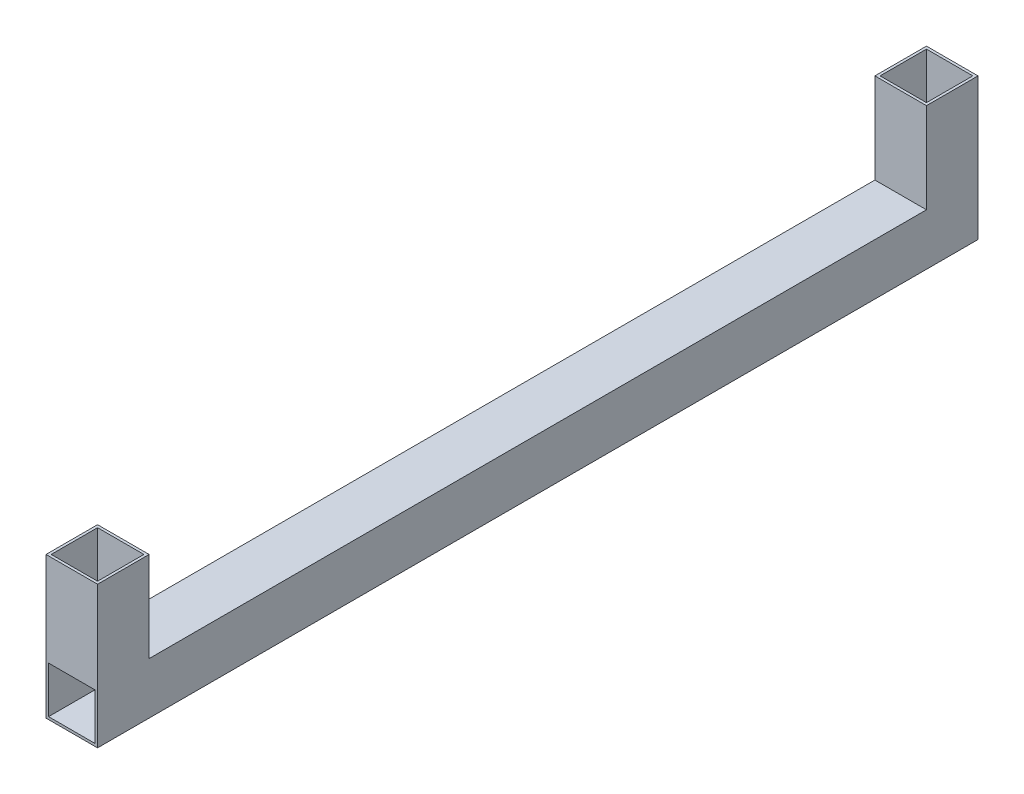
ISO-10303-21;
HEADER;
FILE_DESCRIPTION(('STEP AP214'),'2;1');
FILE_NAME('part.step','',(''),(''),'','','');
FILE_SCHEMA(('AUTOMOTIVE_DESIGN { 1 0 10303 214 1 1 1 1 }'));
ENDSEC;
DATA;
#1=APPLICATION_CONTEXT('core data for automotive mechanical design processes');
#2=APPLICATION_PROTOCOL_DEFINITION('international standard','automotive_design',2000,#1);
#3=PRODUCT_CONTEXT('',#1,'mechanical');
#4=PRODUCT('Part','Part','',(#3));
#5=PRODUCT_RELATED_PRODUCT_CATEGORY('part','',(#4));
#6=PRODUCT_DEFINITION_FORMATION('','',#4);
#7=PRODUCT_DEFINITION_CONTEXT('part definition',#1,'design');
#8=PRODUCT_DEFINITION('design','',#6,#7);
#9=PRODUCT_DEFINITION_SHAPE('','',#8);
#10=(LENGTH_UNIT() NAMED_UNIT(*) SI_UNIT(.MILLI.,.METRE.));
#11=(NAMED_UNIT(*) PLANE_ANGLE_UNIT() SI_UNIT($,.RADIAN.));
#12=(NAMED_UNIT(*) SI_UNIT($,.STERADIAN.) SOLID_ANGLE_UNIT());
#13=UNCERTAINTY_MEASURE_WITH_UNIT(LENGTH_MEASURE(1.E-05),#10,'distance_accuracy_value','');
#14=(GEOMETRIC_REPRESENTATION_CONTEXT(3) GLOBAL_UNCERTAINTY_ASSIGNED_CONTEXT((#13)) GLOBAL_UNIT_ASSIGNED_CONTEXT((#10,
#11,#12)) REPRESENTATION_CONTEXT('',''));
#15=CARTESIAN_POINT('',(0.,0.,0.));
#16=DIRECTION('',(0.,0.,1.));
#17=DIRECTION('',(1.,0.,0.));
#18=AXIS2_PLACEMENT_3D('',#15,#16,#17);
#19=CARTESIAN_POINT('',(-10.,10.,341.6));
#20=DIRECTION('',(0.,-1.,0.));
#21=DIRECTION('',(0.,0.,-1.));
#22=AXIS2_PLACEMENT_3D('',#19,#20,#21);
#23=PLANE('',#22);
#24=DIRECTION('',(-1.,0.,0.));
#25=VECTOR('',#24,1.);
#26=CARTESIAN_POINT('',(-9.99999999999999,10.,321.6));
#27=LINE('',#26,#25);
#28=CARTESIAN_POINT('',(10.,10.,321.6));
#29=VERTEX_POINT('',#28);
#30=CARTESIAN_POINT('',(-10.,10.,321.6));
#31=VERTEX_POINT('',#30);
#32=EDGE_CURVE('E196',#29,#31,#27,.T.);
#33=ORIENTED_EDGE('',*,*,#32,.F.);
#34=DIRECTION('',(0.,0.,-1.));
#35=VECTOR('',#34,1.);
#36=CARTESIAN_POINT('',(10.,10.,341.6));
#37=LINE('',#36,#35);
#38=CARTESIAN_POINT('',(10.,10.,20.));
#39=VERTEX_POINT('',#38);
#40=EDGE_CURVE('E11',#29,#39,#37,.T.);
#41=ORIENTED_EDGE('',*,*,#40,.T.);
#42=DIRECTION('',(1.,0.,0.));
#43=VECTOR('',#42,1.);
#44=CARTESIAN_POINT('',(-10.,10.,20.));
#45=LINE('',#44,#43);
#46=CARTESIAN_POINT('',(-10.,10.,20.0000000000001));
#47=VERTEX_POINT('',#46);
#48=EDGE_CURVE('E293',#47,#39,#45,.T.);
#49=ORIENTED_EDGE('',*,*,#48,.F.);
#50=DIRECTION('',(0.,0.,-1.));
#51=VECTOR('',#50,1.);
#52=CARTESIAN_POINT('',(-10.,10.,341.6));
#53=LINE('',#52,#51);
#54=EDGE_CURVE('E48',#31,#47,#53,.T.);
#55=ORIENTED_EDGE('',*,*,#54,.F.);
#56=EDGE_LOOP('',(#33,#41,#49,#55));
#57=FACE_BOUND('',#56,.T.);
#58=ADVANCED_FACE('F39',(#57),#23,.F.);
#59=CARTESIAN_POINT('',(0.,0.,341.6));
#60=DIRECTION('',(0.,0.,-1.));
#61=DIRECTION('',(-1.,0.,0.));
#62=AXIS2_PLACEMENT_3D('',#59,#60,#61);
#63=PLANE('',#62);
#64=DIRECTION('',(0.,1.,0.));
#65=VECTOR('',#64,1.);
#66=CARTESIAN_POINT('',(10.,-10.,341.6));
#67=LINE('',#66,#65);
#68=CARTESIAN_POINT('',(10.,-10.,341.6));
#69=VERTEX_POINT('',#68);
#70=CARTESIAN_POINT('',(10.,45.,341.6));
#71=VERTEX_POINT('',#70);
#72=EDGE_CURVE('E364',#69,#71,#67,.T.);
#73=ORIENTED_EDGE('',*,*,#72,.T.);
#74=DIRECTION('',(1.,0.,0.));
#75=VECTOR('',#74,1.);
#76=CARTESIAN_POINT('',(-10.,45.,341.6));
#77=LINE('',#76,#75);
#78=CARTESIAN_POINT('',(-10.,45.,341.6));
#79=VERTEX_POINT('',#78);
#80=EDGE_CURVE('E234',#79,#71,#77,.T.);
#81=ORIENTED_EDGE('',*,*,#80,.F.);
#82=DIRECTION('',(0.,-1.,0.));
#83=VECTOR('',#82,1.);
#84=CARTESIAN_POINT('',(-10.,-10.,341.6));
#85=LINE('',#84,#83);
#86=CARTESIAN_POINT('',(-10.,-10.,341.6));
#87=VERTEX_POINT('',#86);
#88=EDGE_CURVE('E367',#79,#87,#85,.T.);
#89=ORIENTED_EDGE('',*,*,#88,.T.);
#90=DIRECTION('',(1.,0.,0.));
#91=VECTOR('',#90,1.);
#92=CARTESIAN_POINT('',(-10.,-10.,341.6));
#93=LINE('',#92,#91);
#94=EDGE_CURVE('E371',#87,#69,#93,.T.);
#95=ORIENTED_EDGE('',*,*,#94,.T.);
#96=EDGE_LOOP('',(#73,#81,#89,#95));
#97=FACE_BOUND('',#96,.T.);
#98=DIRECTION('',(0.,-1.,0.));
#99=VECTOR('',#98,1.);
#100=CARTESIAN_POINT('',(-9.00000000000001,-9.,341.6));
#101=LINE('',#100,#99);
#102=CARTESIAN_POINT('',(-9.00000000000001,9.,341.6));
#103=VERTEX_POINT('',#102);
#104=CARTESIAN_POINT('',(-9.00000000000001,-9.,341.6));
#105=VERTEX_POINT('',#104);
#106=EDGE_CURVE('E321',#103,#105,#101,.T.);
#107=ORIENTED_EDGE('',*,*,#106,.F.);
#108=DIRECTION('',(-1.,0.,0.));
#109=VECTOR('',#108,1.);
#110=CARTESIAN_POINT('',(-9.00000000000001,9.,341.6));
#111=LINE('',#110,#109);
#112=CARTESIAN_POINT('',(9.,9.,341.6));
#113=VERTEX_POINT('',#112);
#114=EDGE_CURVE('E332',#113,#103,#111,.T.);
#115=ORIENTED_EDGE('',*,*,#114,.F.);
#116=DIRECTION('',(0.,1.,0.));
#117=VECTOR('',#116,1.);
#118=CARTESIAN_POINT('',(9.,-9.,341.6));
#119=LINE('',#118,#117);
#120=CARTESIAN_POINT('',(9.,-9.,341.6));
#121=VERTEX_POINT('',#120);
#122=EDGE_CURVE('E328',#121,#113,#119,.T.);
#123=ORIENTED_EDGE('',*,*,#122,.F.);
#124=DIRECTION('',(1.,0.,0.));
#125=VECTOR('',#124,1.);
#126=CARTESIAN_POINT('',(-9.00000000000001,-9.,341.6));
#127=LINE('',#126,#125);
#128=EDGE_CURVE('E324',#105,#121,#127,.T.);
#129=ORIENTED_EDGE('',*,*,#128,.F.);
#130=EDGE_LOOP('',(#107,#115,#123,#129));
#131=FACE_BOUND('',#130,.T.);
#132=ADVANCED_FACE('F421',(#97,#131),#63,.F.);
#133=CARTESIAN_POINT('',(0.,0.,0.));
#134=DIRECTION('',(0.,0.,-1.));
#135=DIRECTION('',(-1.,0.,0.));
#136=AXIS2_PLACEMENT_3D('',#133,#134,#135);
#137=PLANE('',#136);
#138=DIRECTION('',(0.,1.,0.));
#139=VECTOR('',#138,1.);
#140=CARTESIAN_POINT('',(10.,-10.,0.));
#141=LINE('',#140,#139);
#142=CARTESIAN_POINT('',(10.,-10.,0.));
#143=VERTEX_POINT('',#142);
#144=CARTESIAN_POINT('',(10.,45.,0.));
#145=VERTEX_POINT('',#144);
#146=EDGE_CURVE('E363',#143,#145,#141,.T.);
#147=ORIENTED_EDGE('',*,*,#146,.F.);
#148=DIRECTION('',(1.,0.,0.));
#149=VECTOR('',#148,1.);
#150=CARTESIAN_POINT('',(-10.,-10.,0.));
#151=LINE('',#150,#149);
#152=CARTESIAN_POINT('',(-10.,-10.,0.));
#153=VERTEX_POINT('',#152);
#154=EDGE_CURVE('E368',#153,#143,#151,.T.);
#155=ORIENTED_EDGE('',*,*,#154,.F.);
#156=DIRECTION('',(0.,-1.,0.));
#157=VECTOR('',#156,1.);
#158=CARTESIAN_POINT('',(-10.,-10.,0.));
#159=LINE('',#158,#157);
#160=CARTESIAN_POINT('',(-10.,45.,0.));
#161=VERTEX_POINT('',#160);
#162=EDGE_CURVE('E377',#161,#153,#159,.T.);
#163=ORIENTED_EDGE('',*,*,#162,.F.);
#164=DIRECTION('',(-1.,0.,0.));
#165=VECTOR('',#164,1.);
#166=CARTESIAN_POINT('',(-10.,45.,0.));
#167=LINE('',#166,#165);
#168=EDGE_CURVE('E305',#145,#161,#167,.T.);
#169=ORIENTED_EDGE('',*,*,#168,.F.);
#170=EDGE_LOOP('',(#147,#155,#163,#169));
#171=FACE_BOUND('',#170,.T.);
#172=DIRECTION('',(-1.,0.,0.));
#173=VECTOR('',#172,1.);
#174=CARTESIAN_POINT('',(-9.00000000000001,9.,0.));
#175=LINE('',#174,#173);
#176=CARTESIAN_POINT('',(9.,9.,0.));
#177=VERTEX_POINT('',#176);
#178=CARTESIAN_POINT('',(-9.00000000000001,9.,0.));
#179=VERTEX_POINT('',#178);
#180=EDGE_CURVE('E325',#177,#179,#175,.T.);
#181=ORIENTED_EDGE('',*,*,#180,.T.);
#182=DIRECTION('',(0.,-1.,0.));
#183=VECTOR('',#182,1.);
#184=CARTESIAN_POINT('',(-9.00000000000001,-9.,0.));
#185=LINE('',#184,#183);
#186=CARTESIAN_POINT('',(-9.00000000000001,-9.,0.));
#187=VERTEX_POINT('',#186);
#188=EDGE_CURVE('E320',#179,#187,#185,.T.);
#189=ORIENTED_EDGE('',*,*,#188,.T.);
#190=DIRECTION('',(1.,0.,0.));
#191=VECTOR('',#190,1.);
#192=CARTESIAN_POINT('',(-9.00000000000001,-9.,0.));
#193=LINE('',#192,#191);
#194=CARTESIAN_POINT('',(9.,-9.,0.));
#195=VERTEX_POINT('',#194);
#196=EDGE_CURVE('E339',#187,#195,#193,.T.);
#197=ORIENTED_EDGE('',*,*,#196,.T.);
#198=DIRECTION('',(0.,1.,0.));
#199=VECTOR('',#198,1.);
#200=CARTESIAN_POINT('',(9.,-9.,0.));
#201=LINE('',#200,#199);
#202=EDGE_CURVE('E343',#195,#177,#201,.T.);
#203=ORIENTED_EDGE('',*,*,#202,.T.);
#204=EDGE_LOOP('',(#181,#189,#197,#203));
#205=FACE_BOUND('',#204,.T.);
#206=ADVANCED_FACE('F413',(#171,#205),#137,.T.);
#207=CARTESIAN_POINT('',(10.,-10.,341.6));
#208=DIRECTION('',(-1.,0.,0.));
#209=DIRECTION('',(0.,0.,1.));
#210=AXIS2_PLACEMENT_3D('',#207,#208,#209);
#211=PLANE('',#210);
#212=ORIENTED_EDGE('',*,*,#146,.T.);
#213=DIRECTION('',(0.,0.,-1.));
#214=VECTOR('',#213,1.);
#215=CARTESIAN_POINT('',(10.,45.,0.));
#216=LINE('',#215,#214);
#217=CARTESIAN_POINT('',(10.,45.,20.));
#218=VERTEX_POINT('',#217);
#219=EDGE_CURVE('E301',#218,#145,#216,.T.);
#220=ORIENTED_EDGE('',*,*,#219,.F.);
#221=DIRECTION('',(0.,-1.,0.));
#222=VECTOR('',#221,1.);
#223=CARTESIAN_POINT('',(10.,45.,20.));
#224=LINE('',#223,#222);
#225=EDGE_CURVE('E309',#218,#39,#224,.T.);
#226=ORIENTED_EDGE('',*,*,#225,.T.);
#227=ORIENTED_EDGE('',*,*,#40,.F.);
#228=DIRECTION('',(0.,-1.,0.));
#229=VECTOR('',#228,1.);
#230=CARTESIAN_POINT('',(10.,45.,321.6));
#231=LINE('',#230,#229);
#232=CARTESIAN_POINT('',(10.,45.,321.6));
#233=VERTEX_POINT('',#232);
#234=EDGE_CURVE('E248',#233,#29,#231,.T.);
#235=ORIENTED_EDGE('',*,*,#234,.F.);
#236=DIRECTION('',(0.,0.,-1.));
#237=VECTOR('',#236,1.);
#238=CARTESIAN_POINT('',(10.,45.,341.6));
#239=LINE('',#238,#237);
#240=EDGE_CURVE('E238',#71,#233,#239,.T.);
#241=ORIENTED_EDGE('',*,*,#240,.F.);
#242=ORIENTED_EDGE('',*,*,#72,.F.);
#243=DIRECTION('',(0.,0.,-1.));
#244=VECTOR('',#243,1.);
#245=CARTESIAN_POINT('',(10.,-10.,341.6));
#246=LINE('',#245,#244);
#247=EDGE_CURVE('E374',#69,#143,#246,.T.);
#248=ORIENTED_EDGE('',*,*,#247,.T.);
#249=EDGE_LOOP('',(#212,#220,#226,#227,#235,#241,#242,#248));
#250=FACE_BOUND('',#249,.T.);
#251=ADVANCED_FACE('F41',(#250),#211,.F.);
#252=CARTESIAN_POINT('',(-10.,-10.,341.6));
#253=DIRECTION('',(1.,0.,0.));
#254=DIRECTION('',(0.,0.,-1.));
#255=AXIS2_PLACEMENT_3D('',#252,#253,#254);
#256=PLANE('',#255);
#257=ORIENTED_EDGE('',*,*,#162,.T.);
#258=DIRECTION('',(0.,0.,-1.));
#259=VECTOR('',#258,1.);
#260=CARTESIAN_POINT('',(-10.,-10.,341.6));
#261=LINE('',#260,#259);
#262=EDGE_CURVE('E385',#87,#153,#261,.T.);
#263=ORIENTED_EDGE('',*,*,#262,.F.);
#264=ORIENTED_EDGE('',*,*,#88,.F.);
#265=DIRECTION('',(0.,0.,1.));
#266=VECTOR('',#265,1.);
#267=CARTESIAN_POINT('',(-10.,45.,341.6));
#268=LINE('',#267,#266);
#269=CARTESIAN_POINT('',(-9.99999999999999,45.,321.6));
#270=VERTEX_POINT('',#269);
#271=EDGE_CURVE('E230',#270,#79,#268,.T.);
#272=ORIENTED_EDGE('',*,*,#271,.F.);
#273=DIRECTION('',(0.,-1.,0.));
#274=VECTOR('',#273,1.);
#275=CARTESIAN_POINT('',(-9.99999999999999,45.,321.6));
#276=LINE('',#275,#274);
#277=EDGE_CURVE('E63',#270,#31,#276,.T.);
#278=ORIENTED_EDGE('',*,*,#277,.T.);
#279=ORIENTED_EDGE('',*,*,#54,.T.);
#280=DIRECTION('',(0.,-1.,0.));
#281=VECTOR('',#280,1.);
#282=CARTESIAN_POINT('',(-10.,45.,20.));
#283=LINE('',#282,#281);
#284=CARTESIAN_POINT('',(-10.,45.,20.));
#285=VERTEX_POINT('',#284);
#286=EDGE_CURVE('E316',#285,#47,#283,.T.);
#287=ORIENTED_EDGE('',*,*,#286,.F.);
#288=DIRECTION('',(0.,0.,1.));
#289=VECTOR('',#288,1.);
#290=CARTESIAN_POINT('',(-10.,45.,0.));
#291=LINE('',#290,#289);
#292=EDGE_CURVE('E294',#161,#285,#291,.T.);
#293=ORIENTED_EDGE('',*,*,#292,.F.);
#294=EDGE_LOOP('',(#257,#263,#264,#272,#278,#279,#287,#293));
#295=FACE_BOUND('',#294,.T.);
#296=ADVANCED_FACE('F392',(#295),#256,.F.);
#297=CARTESIAN_POINT('',(-10.,-10.,341.6));
#298=DIRECTION('',(0.,1.,0.));
#299=DIRECTION('',(0.,0.,1.));
#300=AXIS2_PLACEMENT_3D('',#297,#298,#299);
#301=PLANE('',#300);
#302=ORIENTED_EDGE('',*,*,#154,.T.);
#303=ORIENTED_EDGE('',*,*,#247,.F.);
#304=ORIENTED_EDGE('',*,*,#94,.F.);
#305=ORIENTED_EDGE('',*,*,#262,.T.);
#306=EDGE_LOOP('',(#302,#303,#304,#305));
#307=FACE_BOUND('',#306,.T.);
#308=ADVANCED_FACE('F410',(#307),#301,.F.);
#309=CARTESIAN_POINT('',(-9.00000000000001,-9.,341.6));
#310=DIRECTION('',(1.,0.,0.));
#311=DIRECTION('',(0.,0.,-1.));
#312=AXIS2_PLACEMENT_3D('',#309,#310,#311);
#313=PLANE('',#312);
#314=ORIENTED_EDGE('',*,*,#188,.F.);
#315=DIRECTION('',(0.,0.,-1.));
#316=VECTOR('',#315,1.);
#317=CARTESIAN_POINT('',(-9.00000000000001,9.,341.6));
#318=LINE('',#317,#316);
#319=EDGE_CURVE('E335',#103,#179,#318,.T.);
#320=ORIENTED_EDGE('',*,*,#319,.F.);
#321=ORIENTED_EDGE('',*,*,#106,.T.);
#322=DIRECTION('',(0.,0.,-1.));
#323=VECTOR('',#322,1.);
#324=CARTESIAN_POINT('',(-9.00000000000001,-9.,341.6));
#325=LINE('',#324,#323);
#326=EDGE_CURVE('E359',#105,#187,#325,.T.);
#327=ORIENTED_EDGE('',*,*,#326,.T.);
#328=EDGE_LOOP('',(#314,#320,#321,#327));
#329=FACE_BOUND('',#328,.T.);
#330=ADVANCED_FACE('F494',(#329),#313,.T.);
#331=CARTESIAN_POINT('',(-9.00000000000001,-9.,341.6));
#332=DIRECTION('',(0.,1.,0.));
#333=DIRECTION('',(0.,0.,1.));
#334=AXIS2_PLACEMENT_3D('',#331,#332,#333);
#335=PLANE('',#334);
#336=ORIENTED_EDGE('',*,*,#196,.F.);
#337=ORIENTED_EDGE('',*,*,#326,.F.);
#338=ORIENTED_EDGE('',*,*,#128,.T.);
#339=DIRECTION('',(0.,0.,-1.));
#340=VECTOR('',#339,1.);
#341=CARTESIAN_POINT('',(9.,-9.,341.6));
#342=LINE('',#341,#340);
#343=EDGE_CURVE('E356',#121,#195,#342,.T.);
#344=ORIENTED_EDGE('',*,*,#343,.T.);
#345=EDGE_LOOP('',(#336,#337,#338,#344));
#346=FACE_BOUND('',#345,.T.);
#347=ADVANCED_FACE('F490',(#346),#335,.T.);
#348=CARTESIAN_POINT('',(9.,-9.,341.6));
#349=DIRECTION('',(-1.,0.,0.));
#350=DIRECTION('',(0.,-1.,0.));
#351=AXIS2_PLACEMENT_3D('',#348,#349,#350);
#352=PLANE('',#351);
#353=ORIENTED_EDGE('',*,*,#202,.F.);
#354=ORIENTED_EDGE('',*,*,#343,.F.);
#355=ORIENTED_EDGE('',*,*,#122,.T.);
#356=DIRECTION('',(0.,0.,-1.));
#357=VECTOR('',#356,1.);
#358=CARTESIAN_POINT('',(9.,9.,341.6));
#359=LINE('',#358,#357);
#360=EDGE_CURVE('E353',#113,#177,#359,.T.);
#361=ORIENTED_EDGE('',*,*,#360,.T.);
#362=EDGE_LOOP('',(#353,#354,#355,#361));
#363=FACE_BOUND('',#362,.T.);
#364=ADVANCED_FACE('F486',(#363),#352,.T.);
#365=CARTESIAN_POINT('',(-9.00000000000001,9.,341.6));
#366=DIRECTION('',(0.,-1.,0.));
#367=DIRECTION('',(0.,0.,-1.));
#368=AXIS2_PLACEMENT_3D('',#365,#366,#367);
#369=PLANE('',#368);
#370=ORIENTED_EDGE('',*,*,#180,.F.);
#371=ORIENTED_EDGE('',*,*,#360,.F.);
#372=ORIENTED_EDGE('',*,*,#114,.T.);
#373=ORIENTED_EDGE('',*,*,#319,.T.);
#374=EDGE_LOOP('',(#370,#371,#372,#373));
#375=FACE_BOUND('',#374,.T.);
#376=ADVANCED_FACE('F481',(#375),#369,.T.);
#377=CARTESIAN_POINT('',(0.,45.,0.));
#378=DIRECTION('',(0.,1.,0.));
#379=DIRECTION('',(0.,0.,1.));
#380=AXIS2_PLACEMENT_3D('',#377,#378,#379);
#381=PLANE('',#380);
#382=ORIENTED_EDGE('',*,*,#292,.T.);
#383=DIRECTION('',(1.,0.,0.));
#384=VECTOR('',#383,1.);
#385=CARTESIAN_POINT('',(-10.,45.,20.));
#386=LINE('',#385,#384);
#387=EDGE_CURVE('E298',#285,#218,#386,.T.);
#388=ORIENTED_EDGE('',*,*,#387,.T.);
#389=ORIENTED_EDGE('',*,*,#219,.T.);
#390=ORIENTED_EDGE('',*,*,#168,.T.);
#391=EDGE_LOOP('',(#382,#388,#389,#390));
#392=FACE_BOUND('',#391,.T.);
#393=DIRECTION('',(1.,0.,0.));
#394=VECTOR('',#393,1.);
#395=CARTESIAN_POINT('',(-9.00000000000001,45.,19.));
#396=LINE('',#395,#394);
#397=CARTESIAN_POINT('',(-9.00000000000001,45.,19.));
#398=VERTEX_POINT('',#397);
#399=CARTESIAN_POINT('',(9.,45.,19.));
#400=VERTEX_POINT('',#399);
#401=EDGE_CURVE('E255',#398,#400,#396,.T.);
#402=ORIENTED_EDGE('',*,*,#401,.F.);
#403=DIRECTION('',(0.,0.,1.));
#404=VECTOR('',#403,1.);
#405=CARTESIAN_POINT('',(-9.00000000000001,45.,1.));
#406=LINE('',#405,#404);
#407=CARTESIAN_POINT('',(-9.00000000000001,45.,1.));
#408=VERTEX_POINT('',#407);
#409=EDGE_CURVE('E252',#408,#398,#406,.T.);
#410=ORIENTED_EDGE('',*,*,#409,.F.);
#411=DIRECTION('',(-1.,0.,0.));
#412=VECTOR('',#411,1.);
#413=CARTESIAN_POINT('',(-9.00000000000001,45.,1.));
#414=LINE('',#413,#412);
#415=CARTESIAN_POINT('',(9.,45.,1.));
#416=VERTEX_POINT('',#415);
#417=EDGE_CURVE('E263',#416,#408,#414,.T.);
#418=ORIENTED_EDGE('',*,*,#417,.F.);
#419=DIRECTION('',(0.,0.,-1.));
#420=VECTOR('',#419,1.);
#421=CARTESIAN_POINT('',(9.,45.,1.));
#422=LINE('',#421,#420);
#423=EDGE_CURVE('E259',#400,#416,#422,.T.);
#424=ORIENTED_EDGE('',*,*,#423,.F.);
#425=EDGE_LOOP('',(#402,#410,#418,#424));
#426=FACE_BOUND('',#425,.T.);
#427=ADVANCED_FACE('F402',(#392,#426),#381,.T.);
#428=CARTESIAN_POINT('',(-10.,45.,20.));
#429=DIRECTION('',(0.,0.,-1.));
#430=DIRECTION('',(-1.,0.,0.));
#431=AXIS2_PLACEMENT_3D('',#428,#429,#430);
#432=PLANE('',#431);
#433=ORIENTED_EDGE('',*,*,#48,.T.);
#434=ORIENTED_EDGE('',*,*,#225,.F.);
#435=ORIENTED_EDGE('',*,*,#387,.F.);
#436=ORIENTED_EDGE('',*,*,#286,.T.);
#437=EDGE_LOOP('',(#433,#434,#435,#436));
#438=FACE_BOUND('',#437,.T.);
#439=ADVANCED_FACE('F399',(#438),#432,.F.);
#440=CARTESIAN_POINT('',(-9.00000000000001,45.,1.));
#441=DIRECTION('',(1.,0.,0.));
#442=DIRECTION('',(0.,0.,-1.));
#443=AXIS2_PLACEMENT_3D('',#440,#441,#442);
#444=PLANE('',#443);
#445=DIRECTION('',(0.,0.,1.));
#446=VECTOR('',#445,1.);
#447=CARTESIAN_POINT('',(-9.00000000000001,10.,1.));
#448=LINE('',#447,#446);
#449=CARTESIAN_POINT('',(-9.00000000000001,10.,1.));
#450=VERTEX_POINT('',#449);
#451=CARTESIAN_POINT('',(-9.00000000000001,10.,19.));
#452=VERTEX_POINT('',#451);
#453=EDGE_CURVE('E251',#450,#452,#448,.T.);
#454=ORIENTED_EDGE('',*,*,#453,.F.);
#455=DIRECTION('',(0.,-1.,0.));
#456=VECTOR('',#455,1.);
#457=CARTESIAN_POINT('',(-9.00000000000001,45.,1.));
#458=LINE('',#457,#456);
#459=EDGE_CURVE('E266',#408,#450,#458,.T.);
#460=ORIENTED_EDGE('',*,*,#459,.F.);
#461=ORIENTED_EDGE('',*,*,#409,.T.);
#462=DIRECTION('',(0.,-1.,0.));
#463=VECTOR('',#462,1.);
#464=CARTESIAN_POINT('',(-9.00000000000001,45.,19.));
#465=LINE('',#464,#463);
#466=EDGE_CURVE('E289',#398,#452,#465,.T.);
#467=ORIENTED_EDGE('',*,*,#466,.T.);
#468=EDGE_LOOP('',(#454,#460,#461,#467));
#469=FACE_BOUND('',#468,.T.);
#470=ADVANCED_FACE('F462',(#469),#444,.T.);
#471=CARTESIAN_POINT('',(-9.00000000000001,45.,19.));
#472=DIRECTION('',(0.,0.,-1.));
#473=DIRECTION('',(-1.,0.,0.));
#474=AXIS2_PLACEMENT_3D('',#471,#472,#473);
#475=PLANE('',#474);
#476=DIRECTION('',(1.,0.,0.));
#477=VECTOR('',#476,1.);
#478=CARTESIAN_POINT('',(-9.00000000000001,10.,19.));
#479=LINE('',#478,#477);
#480=CARTESIAN_POINT('',(9.,10.,19.));
#481=VERTEX_POINT('',#480);
#482=EDGE_CURVE('E270',#452,#481,#479,.T.);
#483=ORIENTED_EDGE('',*,*,#482,.F.);
#484=ORIENTED_EDGE('',*,*,#466,.F.);
#485=ORIENTED_EDGE('',*,*,#401,.T.);
#486=DIRECTION('',(0.,-1.,0.));
#487=VECTOR('',#486,1.);
#488=CARTESIAN_POINT('',(9.,45.,19.));
#489=LINE('',#488,#487);
#490=EDGE_CURVE('E286',#400,#481,#489,.T.);
#491=ORIENTED_EDGE('',*,*,#490,.T.);
#492=EDGE_LOOP('',(#483,#484,#485,#491));
#493=FACE_BOUND('',#492,.T.);
#494=ADVANCED_FACE('F466',(#493),#475,.T.);
#495=CARTESIAN_POINT('',(9.,45.,1.));
#496=DIRECTION('',(-1.,0.,0.));
#497=DIRECTION('',(0.,0.,1.));
#498=AXIS2_PLACEMENT_3D('',#495,#496,#497);
#499=PLANE('',#498);
#500=DIRECTION('',(0.,0.,-1.));
#501=VECTOR('',#500,1.);
#502=CARTESIAN_POINT('',(9.,10.,1.));
#503=LINE('',#502,#501);
#504=CARTESIAN_POINT('',(9.,10.,1.));
#505=VERTEX_POINT('',#504);
#506=EDGE_CURVE('E274',#481,#505,#503,.T.);
#507=ORIENTED_EDGE('',*,*,#506,.F.);
#508=ORIENTED_EDGE('',*,*,#490,.F.);
#509=ORIENTED_EDGE('',*,*,#423,.T.);
#510=DIRECTION('',(0.,-1.,0.));
#511=VECTOR('',#510,1.);
#512=CARTESIAN_POINT('',(9.,45.,1.));
#513=LINE('',#512,#511);
#514=EDGE_CURVE('E283',#416,#505,#513,.T.);
#515=ORIENTED_EDGE('',*,*,#514,.T.);
#516=EDGE_LOOP('',(#507,#508,#509,#515));
#517=FACE_BOUND('',#516,.T.);
#518=ADVANCED_FACE('F453',(#517),#499,.T.);
#519=CARTESIAN_POINT('',(-9.00000000000001,45.,1.));
#520=DIRECTION('',(0.,0.,1.));
#521=DIRECTION('',(1.,0.,0.));
#522=AXIS2_PLACEMENT_3D('',#519,#520,#521);
#523=PLANE('',#522);
#524=DIRECTION('',(-1.,0.,0.));
#525=VECTOR('',#524,1.);
#526=CARTESIAN_POINT('',(-9.00000000000001,10.,1.));
#527=LINE('',#526,#525);
#528=EDGE_CURVE('E256',#505,#450,#527,.T.);
#529=ORIENTED_EDGE('',*,*,#528,.F.);
#530=ORIENTED_EDGE('',*,*,#514,.F.);
#531=ORIENTED_EDGE('',*,*,#417,.T.);
#532=ORIENTED_EDGE('',*,*,#459,.T.);
#533=EDGE_LOOP('',(#529,#530,#531,#532));
#534=FACE_BOUND('',#533,.T.);
#535=ADVANCED_FACE('F448',(#534),#523,.T.);
#536=ORIENTED_EDGE('',*,*,#528,.T.);
#537=ORIENTED_EDGE('',*,*,#453,.T.);
#538=ORIENTED_EDGE('',*,*,#482,.T.);
#539=ORIENTED_EDGE('',*,*,#506,.T.);
#540=EDGE_LOOP('',(#536,#537,#538,#539));
#541=FACE_BOUND('',#540,.T.);
#542=ADVANCED_FACE('F434',(#541),#23,.F.);
#543=CARTESIAN_POINT('',(0.,45.,0.));
#544=DIRECTION('',(0.,-1.,0.));
#545=DIRECTION('',(0.,0.,-1.));
#546=AXIS2_PLACEMENT_3D('',#543,#544,#545);
#547=PLANE('',#546);
#548=ORIENTED_EDGE('',*,*,#271,.T.);
#549=ORIENTED_EDGE('',*,*,#80,.T.);
#550=ORIENTED_EDGE('',*,*,#240,.T.);
#551=DIRECTION('',(-1.,0.,0.));
#552=VECTOR('',#551,1.);
#553=CARTESIAN_POINT('',(-9.99999999999999,45.,321.6));
#554=LINE('',#553,#552);
#555=EDGE_CURVE('E241',#233,#270,#554,.T.);
#556=ORIENTED_EDGE('',*,*,#555,.T.);
#557=EDGE_LOOP('',(#548,#549,#550,#556));
#558=FACE_BOUND('',#557,.T.);
#559=DIRECTION('',(0.,0.,1.));
#560=VECTOR('',#559,1.);
#561=CARTESIAN_POINT('',(-8.99999999999998,45.,340.6));
#562=LINE('',#561,#560);
#563=CARTESIAN_POINT('',(-8.99999999999999,45.,322.6));
#564=VERTEX_POINT('',#563);
#565=CARTESIAN_POINT('',(-8.99999999999998,45.,340.6));
#566=VERTEX_POINT('',#565);
#567=EDGE_CURVE('E178',#564,#566,#562,.T.);
#568=ORIENTED_EDGE('',*,*,#567,.F.);
#569=DIRECTION('',(-1.,0.,0.));
#570=VECTOR('',#569,1.);
#571=CARTESIAN_POINT('',(-8.99999999999999,45.,322.6));
#572=LINE('',#571,#570);
#573=CARTESIAN_POINT('',(9.00000000000001,45.,322.6));
#574=VERTEX_POINT('',#573);
#575=EDGE_CURVE('E206',#574,#564,#572,.T.);
#576=ORIENTED_EDGE('',*,*,#575,.F.);
#577=DIRECTION('',(0.,0.,-1.));
#578=VECTOR('',#577,1.);
#579=CARTESIAN_POINT('',(9.00000000000002,45.,340.6));
#580=LINE('',#579,#578);
#581=CARTESIAN_POINT('',(9.00000000000002,45.,340.6));
#582=VERTEX_POINT('',#581);
#583=EDGE_CURVE('E202',#582,#574,#580,.T.);
#584=ORIENTED_EDGE('',*,*,#583,.F.);
#585=DIRECTION('',(1.,0.,0.));
#586=VECTOR('',#585,1.);
#587=CARTESIAN_POINT('',(-8.99999999999998,45.,340.6));
#588=LINE('',#587,#586);
#589=EDGE_CURVE('E187',#566,#582,#588,.T.);
#590=ORIENTED_EDGE('',*,*,#589,.F.);
#591=EDGE_LOOP('',(#568,#576,#584,#590));
#592=FACE_BOUND('',#591,.T.);
#593=ADVANCED_FACE('F200',(#558,#592),#547,.F.);
#594=CARTESIAN_POINT('',(-9.99999999999999,45.,321.6));
#595=DIRECTION('',(0.,0.,1.));
#596=DIRECTION('',(1.,0.,0.));
#597=AXIS2_PLACEMENT_3D('',#594,#595,#596);
#598=PLANE('',#597);
#599=ORIENTED_EDGE('',*,*,#32,.T.);
#600=ORIENTED_EDGE('',*,*,#277,.F.);
#601=ORIENTED_EDGE('',*,*,#555,.F.);
#602=ORIENTED_EDGE('',*,*,#234,.T.);
#603=EDGE_LOOP('',(#599,#600,#601,#602));
#604=FACE_BOUND('',#603,.T.);
#605=ADVANCED_FACE('F426',(#604),#598,.F.);
#606=CARTESIAN_POINT('',(-8.99999999999998,45.,340.6));
#607=DIRECTION('',(1.,0.,0.));
#608=DIRECTION('',(0.,0.,-1.));
#609=AXIS2_PLACEMENT_3D('',#606,#607,#608);
#610=PLANE('',#609);
#611=DIRECTION('',(0.,0.,1.));
#612=VECTOR('',#611,1.);
#613=CARTESIAN_POINT('',(-8.99999999999998,10.,340.6));
#614=LINE('',#613,#612);
#615=CARTESIAN_POINT('',(-8.99999999999999,10.,322.6));
#616=VERTEX_POINT('',#615);
#617=CARTESIAN_POINT('',(-8.99999999999998,10.,340.6));
#618=VERTEX_POINT('',#617);
#619=EDGE_CURVE('E211',#616,#618,#614,.T.);
#620=ORIENTED_EDGE('',*,*,#619,.F.);
#621=DIRECTION('',(0.,-1.,0.));
#622=VECTOR('',#621,1.);
#623=CARTESIAN_POINT('',(-8.99999999999999,45.,322.6));
#624=LINE('',#623,#622);
#625=EDGE_CURVE('E55',#564,#616,#624,.T.);
#626=ORIENTED_EDGE('',*,*,#625,.F.);
#627=ORIENTED_EDGE('',*,*,#567,.T.);
#628=DIRECTION('',(0.,-1.,0.));
#629=VECTOR('',#628,1.);
#630=CARTESIAN_POINT('',(-8.99999999999998,45.,340.6));
#631=LINE('',#630,#629);
#632=EDGE_CURVE('E181',#566,#618,#631,.T.);
#633=ORIENTED_EDGE('',*,*,#632,.T.);
#634=EDGE_LOOP('',(#620,#626,#627,#633));
#635=FACE_BOUND('',#634,.T.);
#636=ADVANCED_FACE('F180',(#635),#610,.T.);
#637=CARTESIAN_POINT('',(-8.99999999999998,45.,340.6));
#638=DIRECTION('',(0.,0.,-1.));
#639=DIRECTION('',(-1.,0.,0.));
#640=AXIS2_PLACEMENT_3D('',#637,#638,#639);
#641=PLANE('',#640);
#642=DIRECTION('',(1.,0.,0.));
#643=VECTOR('',#642,1.);
#644=CARTESIAN_POINT('',(-8.99999999999998,10.,340.6));
#645=LINE('',#644,#643);
#646=CARTESIAN_POINT('',(9.00000000000002,10.,340.6));
#647=VERTEX_POINT('',#646);
#648=EDGE_CURVE('E194',#618,#647,#645,.T.);
#649=ORIENTED_EDGE('',*,*,#648,.F.);
#650=ORIENTED_EDGE('',*,*,#632,.F.);
#651=ORIENTED_EDGE('',*,*,#589,.T.);
#652=DIRECTION('',(0.,-1.,0.));
#653=VECTOR('',#652,1.);
#654=CARTESIAN_POINT('',(9.00000000000002,45.,340.6));
#655=LINE('',#654,#653);
#656=EDGE_CURVE('E197',#582,#647,#655,.T.);
#657=ORIENTED_EDGE('',*,*,#656,.T.);
#658=EDGE_LOOP('',(#649,#650,#651,#657));
#659=FACE_BOUND('',#658,.T.);
#660=ADVANCED_FACE('F191',(#659),#641,.T.);
#661=CARTESIAN_POINT('',(9.00000000000002,45.,340.6));
#662=DIRECTION('',(-1.,0.,0.));
#663=DIRECTION('',(0.,0.,1.));
#664=AXIS2_PLACEMENT_3D('',#661,#662,#663);
#665=PLANE('',#664);
#666=DIRECTION('',(0.,0.,-1.));
#667=VECTOR('',#666,1.);
#668=CARTESIAN_POINT('',(9.00000000000002,10.,340.6));
#669=LINE('',#668,#667);
#670=CARTESIAN_POINT('',(9.00000000000001,10.,322.6));
#671=VERTEX_POINT('',#670);
#672=EDGE_CURVE('E216',#647,#671,#669,.T.);
#673=ORIENTED_EDGE('',*,*,#672,.F.);
#674=ORIENTED_EDGE('',*,*,#656,.F.);
#675=ORIENTED_EDGE('',*,*,#583,.T.);
#676=DIRECTION('',(0.,-1.,0.));
#677=VECTOR('',#676,1.);
#678=CARTESIAN_POINT('',(9.00000000000001,45.,322.6));
#679=LINE('',#678,#677);
#680=EDGE_CURVE('E225',#574,#671,#679,.T.);
#681=ORIENTED_EDGE('',*,*,#680,.T.);
#682=EDGE_LOOP('',(#673,#674,#675,#681));
#683=FACE_BOUND('',#682,.T.);
#684=ADVANCED_FACE('F606',(#683),#665,.T.);
#685=CARTESIAN_POINT('',(-8.99999999999999,45.,322.6));
#686=DIRECTION('',(0.,0.,1.));
#687=DIRECTION('',(1.,0.,0.));
#688=AXIS2_PLACEMENT_3D('',#685,#686,#687);
#689=PLANE('',#688);
#690=DIRECTION('',(-1.,0.,0.));
#691=VECTOR('',#690,1.);
#692=CARTESIAN_POINT('',(-8.99999999999999,10.,322.6));
#693=LINE('',#692,#691);
#694=EDGE_CURVE('E188',#671,#616,#693,.T.);
#695=ORIENTED_EDGE('',*,*,#694,.F.);
#696=ORIENTED_EDGE('',*,*,#680,.F.);
#697=ORIENTED_EDGE('',*,*,#575,.T.);
#698=ORIENTED_EDGE('',*,*,#625,.T.);
#699=EDGE_LOOP('',(#695,#696,#697,#698));
#700=FACE_BOUND('',#699,.T.);
#701=ADVANCED_FACE('F445',(#700),#689,.T.);
#702=ORIENTED_EDGE('',*,*,#694,.T.);
#703=ORIENTED_EDGE('',*,*,#619,.T.);
#704=ORIENTED_EDGE('',*,*,#648,.T.);
#705=ORIENTED_EDGE('',*,*,#672,.T.);
#706=EDGE_LOOP('',(#702,#703,#704,#705));
#707=FACE_BOUND('',#706,.T.);
#708=ADVANCED_FACE('F438',(#707),#23,.F.);
#709=CLOSED_SHELL('',(#58,#132,#206,#251,#296,#308,#330,#347,#364,#376,#427,#439,#470,#494,#518,
#535,#542,#593,#605,#636,#660,#684,#701,#708));
#710=MANIFOLD_SOLID_BREP('B2',#709);
#711=ADVANCED_BREP_SHAPE_REPRESENTATION('',(#18,#710),#14);
#712=SHAPE_DEFINITION_REPRESENTATION(#9,#711);
ENDSEC;
END-ISO-10303-21;
